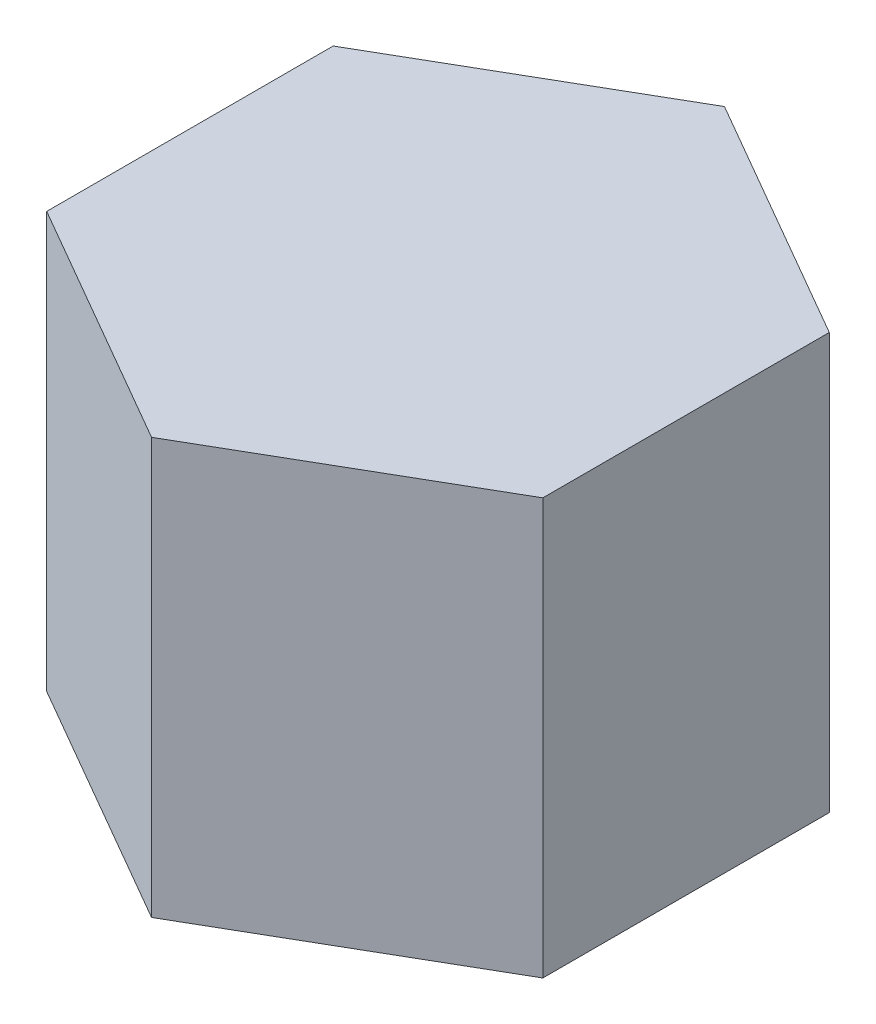
ISO-10303-21;
HEADER;
FILE_DESCRIPTION(('STEP AP214'),'2;1');
FILE_NAME('part.step','',(''),(''),'','','');
FILE_SCHEMA(('AUTOMOTIVE_DESIGN { 1 0 10303 214 1 1 1 1 }'));
ENDSEC;
DATA;
#1=APPLICATION_CONTEXT('core data for automotive mechanical design processes');
#2=APPLICATION_PROTOCOL_DEFINITION('international standard','automotive_design',2000,#1);
#3=PRODUCT_CONTEXT('',#1,'mechanical');
#4=PRODUCT('Part','Part','',(#3));
#5=PRODUCT_RELATED_PRODUCT_CATEGORY('part','',(#4));
#6=PRODUCT_DEFINITION_FORMATION('','',#4);
#7=PRODUCT_DEFINITION_CONTEXT('part definition',#1,'design');
#8=PRODUCT_DEFINITION('design','',#6,#7);
#9=PRODUCT_DEFINITION_SHAPE('','',#8);
#10=(LENGTH_UNIT() NAMED_UNIT(*) SI_UNIT(.MILLI.,.METRE.));
#11=(NAMED_UNIT(*) PLANE_ANGLE_UNIT() SI_UNIT($,.RADIAN.));
#12=(NAMED_UNIT(*) SI_UNIT($,.STERADIAN.) SOLID_ANGLE_UNIT());
#13=UNCERTAINTY_MEASURE_WITH_UNIT(LENGTH_MEASURE(1.E-05),#10,'distance_accuracy_value','');
#14=(GEOMETRIC_REPRESENTATION_CONTEXT(3) GLOBAL_UNCERTAINTY_ASSIGNED_CONTEXT((#13)) GLOBAL_UNIT_ASSIGNED_CONTEXT((#10,
#11,#12)) REPRESENTATION_CONTEXT('',''));
#15=CARTESIAN_POINT('',(0.,0.,0.));
#16=DIRECTION('',(0.,0.,1.));
#17=DIRECTION('',(1.,0.,0.));
#18=AXIS2_PLACEMENT_3D('',#15,#16,#17);
#19=CARTESIAN_POINT('',(206.642660308706,-148.537700895744,289.774920412926));
#20=DIRECTION('',(-0.499999999999943,0.,-0.866025403784472));
#21=DIRECTION('',(-0.866025403784472,0.,0.499999999999943));
#22=AXIS2_PLACEMENT_3D('',#19,#20,#21);
#23=PLANE('',#22);
#24=CARTESIAN_POINT('',(206.339551417382,-149.045793579175,289.949920412926));
#25=DIRECTION('',(0.866025403784471,0.,-0.499999999999943));
#26=VECTOR('',#25,1.);
#27=LINE('',#24,#26);
#28=CARTESIAN_POINT('',(206.339551417382,-149.045793579175,289.949920412926));
#29=VERTEX_POINT('',#28);
#30=CARTESIAN_POINT('',(206.642660308706,-149.045793579175,289.774920412926));
#31=VERTEX_POINT('',#30);
#32=EDGE_CURVE('E170',#29,#31,#27,.T.);
#33=ORIENTED_EDGE('',*,*,#32,.T.);
#34=CARTESIAN_POINT('',(206.642660308706,-148.537700895744,289.774920412926));
#35=DIRECTION('',(0.,-1.,0.));
#36=VECTOR('',#35,1.);
#37=LINE('',#34,#36);
#38=CARTESIAN_POINT('',(206.642660308706,-148.537700895744,289.774920412926));
#39=VERTEX_POINT('',#38);
#40=EDGE_CURVE('E35',#39,#31,#37,.T.);
#41=ORIENTED_EDGE('',*,*,#40,.F.);
#42=CARTESIAN_POINT('',(206.339551417382,-148.537700895744,289.949920412926));
#43=DIRECTION('',(0.866025403784471,0.,-0.499999999999943));
#44=VECTOR('',#43,1.);
#45=LINE('',#42,#44);
#46=CARTESIAN_POINT('',(206.339551417382,-148.537700895744,289.949920412926));
#47=VERTEX_POINT('',#46);
#48=EDGE_CURVE('E159',#47,#39,#45,.T.);
#49=ORIENTED_EDGE('',*,*,#48,.F.);
#50=CARTESIAN_POINT('',(206.339551417382,-148.537700895744,289.949920412926));
#51=DIRECTION('',(0.,-1.,0.));
#52=VECTOR('',#51,1.);
#53=LINE('',#50,#52);
#54=EDGE_CURVE('E10',#47,#29,#53,.T.);
#55=ORIENTED_EDGE('',*,*,#54,.T.);
#56=EDGE_LOOP('',(#33,#41,#49,#55));
#57=FACE_BOUND('',#56,.T.);
#58=ADVANCED_FACE('F16',(#57),#23,.F.);
#59=CARTESIAN_POINT('',(206.339551417382,-148.537700895744,289.949920412926));
#60=DIRECTION('',(0.500000000000062,0.,-0.866025403784403));
#61=DIRECTION('',(-0.866025403784403,0.,-0.500000000000062));
#62=AXIS2_PLACEMENT_3D('',#59,#60,#61);
#63=PLANE('',#62);
#64=CARTESIAN_POINT('',(206.036442526057,-149.045793579175,289.774920412925));
#65=DIRECTION('',(0.866025403784403,0.,0.500000000000062));
#66=VECTOR('',#65,1.);
#67=LINE('',#64,#66);
#68=CARTESIAN_POINT('',(206.036442526057,-149.045793579175,289.774920412925));
#69=VERTEX_POINT('',#68);
#70=EDGE_CURVE('E167',#69,#29,#67,.T.);
#71=ORIENTED_EDGE('',*,*,#70,.T.);
#72=ORIENTED_EDGE('',*,*,#54,.F.);
#73=CARTESIAN_POINT('',(206.036442526057,-148.537700895744,289.774920412925));
#74=DIRECTION('',(0.866025403784403,0.,0.500000000000062));
#75=VECTOR('',#74,1.);
#76=LINE('',#73,#75);
#77=CARTESIAN_POINT('',(206.036442526057,-148.537700895744,289.774920412925));
#78=VERTEX_POINT('',#77);
#79=EDGE_CURVE('E156',#78,#47,#76,.T.);
#80=ORIENTED_EDGE('',*,*,#79,.F.);
#81=CARTESIAN_POINT('',(206.036442526057,-148.537700895744,289.774920412925));
#82=DIRECTION('',(0.,-1.,0.));
#83=VECTOR('',#82,1.);
#84=LINE('',#81,#83);
#85=EDGE_CURVE('E27',#78,#69,#84,.T.);
#86=ORIENTED_EDGE('',*,*,#85,.T.);
#87=EDGE_LOOP('',(#71,#72,#80,#86));
#88=FACE_BOUND('',#87,.T.);
#89=ADVANCED_FACE('F189',(#88),#63,.F.);
#90=CARTESIAN_POINT('',(206.036442526057,-148.537700895744,290.831971220494));
#91=DIRECTION('',(1.,0.,0.));
#92=DIRECTION('',(0.,1.,0.));
#93=AXIS2_PLACEMENT_3D('',#90,#91,#92);
#94=PLANE('',#93);
#95=CARTESIAN_POINT('',(206.036442526057,-149.045793579175,289.424920412926));
#96=DIRECTION('',(0.,0.,1.));
#97=VECTOR('',#96,1.);
#98=LINE('',#95,#97);
#99=CARTESIAN_POINT('',(206.036442526057,-149.045793579175,289.424920412926));
#100=VERTEX_POINT('',#99);
#101=EDGE_CURVE('E163',#100,#69,#98,.T.);
#102=ORIENTED_EDGE('',*,*,#101,.T.);
#103=ORIENTED_EDGE('',*,*,#85,.F.);
#104=CARTESIAN_POINT('',(206.036442526057,-148.537700895744,289.424920412926));
#105=DIRECTION('',(0.,0.,1.));
#106=VECTOR('',#105,1.);
#107=LINE('',#104,#106);
#108=CARTESIAN_POINT('',(206.036442526057,-148.537700895744,289.424920412926));
#109=VERTEX_POINT('',#108);
#110=EDGE_CURVE('E106',#109,#78,#107,.T.);
#111=ORIENTED_EDGE('',*,*,#110,.F.);
#112=CARTESIAN_POINT('',(206.036442526057,-148.537700895744,289.424920412926));
#113=DIRECTION('',(0.,-1.,0.));
#114=VECTOR('',#113,1.);
#115=LINE('',#112,#114);
#116=EDGE_CURVE('E94',#109,#100,#115,.T.);
#117=ORIENTED_EDGE('',*,*,#116,.T.);
#118=EDGE_LOOP('',(#102,#103,#111,#117));
#119=FACE_BOUND('',#118,.T.);
#120=ADVANCED_FACE('F198',(#119),#94,.F.);
#121=CARTESIAN_POINT('',(206.036442526057,-148.537700895744,289.424920412926));
#122=DIRECTION('',(0.499999999999978,0.,0.866025403784452));
#123=DIRECTION('',(0.866025403784452,0.,-0.499999999999978));
#124=AXIS2_PLACEMENT_3D('',#121,#122,#123);
#125=PLANE('',#124);
#126=CARTESIAN_POINT('',(206.339551417382,-149.045793579175,289.249920412926));
#127=DIRECTION('',(-0.866025403784452,0.,0.499999999999978));
#128=VECTOR('',#127,1.);
#129=LINE('',#126,#128);
#130=CARTESIAN_POINT('',(206.339551417382,-149.045793579175,289.249920412926));
#131=VERTEX_POINT('',#130);
#132=EDGE_CURVE('E162',#131,#100,#129,.T.);
#133=ORIENTED_EDGE('',*,*,#132,.T.);
#134=ORIENTED_EDGE('',*,*,#116,.F.);
#135=CARTESIAN_POINT('',(206.339551417382,-148.537700895744,289.249920412926));
#136=DIRECTION('',(-0.866025403784452,0.,0.499999999999978));
#137=VECTOR('',#136,1.);
#138=LINE('',#135,#137);
#139=CARTESIAN_POINT('',(206.339551417382,-148.537700895744,289.249920412926));
#140=VERTEX_POINT('',#139);
#141=EDGE_CURVE('E98',#140,#109,#138,.T.);
#142=ORIENTED_EDGE('',*,*,#141,.F.);
#143=CARTESIAN_POINT('',(206.339551417382,-148.537700895744,289.249920412926));
#144=DIRECTION('',(0.,-1.,0.));
#145=VECTOR('',#144,1.);
#146=LINE('',#143,#145);
#147=EDGE_CURVE('E79',#140,#131,#146,.T.);
#148=ORIENTED_EDGE('',*,*,#147,.T.);
#149=EDGE_LOOP('',(#133,#134,#142,#148));
#150=FACE_BOUND('',#149,.T.);
#151=ADVANCED_FACE('F100',(#150),#125,.F.);
#152=CARTESIAN_POINT('',(206.339551417382,-148.537700895744,289.249920412926));
#153=DIRECTION('',(-0.499999999999943,0.,0.866025403784472));
#154=DIRECTION('',(0.866025403784472,0.,0.499999999999943));
#155=AXIS2_PLACEMENT_3D('',#152,#153,#154);
#156=PLANE('',#155);
#157=CARTESIAN_POINT('',(206.642660308706,-149.045793579175,289.424920412926));
#158=DIRECTION('',(-0.866025403784471,0.,-0.499999999999943));
#159=VECTOR('',#158,1.);
#160=LINE('',#157,#159);
#161=CARTESIAN_POINT('',(206.642660308706,-149.045793579175,289.424920412926));
#162=VERTEX_POINT('',#161);
#163=EDGE_CURVE('E88',#162,#131,#160,.T.);
#164=ORIENTED_EDGE('',*,*,#163,.T.);
#165=ORIENTED_EDGE('',*,*,#147,.F.);
#166=CARTESIAN_POINT('',(206.642660308706,-148.537700895744,289.424920412926));
#167=DIRECTION('',(-0.866025403784471,0.,-0.499999999999943));
#168=VECTOR('',#167,1.);
#169=LINE('',#166,#168);
#170=CARTESIAN_POINT('',(206.642660308706,-148.537700895744,289.424920412926));
#171=VERTEX_POINT('',#170);
#172=EDGE_CURVE('E84',#171,#140,#169,.T.);
#173=ORIENTED_EDGE('',*,*,#172,.F.);
#174=CARTESIAN_POINT('',(206.642660308706,-148.537700895744,289.424920412926));
#175=DIRECTION('',(0.,-1.,0.));
#176=VECTOR('',#175,1.);
#177=LINE('',#174,#176);
#178=EDGE_CURVE('E58',#171,#162,#177,.T.);
#179=ORIENTED_EDGE('',*,*,#178,.T.);
#180=EDGE_LOOP('',(#164,#165,#173,#179));
#181=FACE_BOUND('',#180,.T.);
#182=ADVANCED_FACE('F82',(#181),#156,.F.);
#183=CARTESIAN_POINT('',(206.642660308706,-148.537700895744,290.831971220494));
#184=DIRECTION('',(-1.,0.,0.));
#185=DIRECTION('',(0.,-1.,0.));
#186=AXIS2_PLACEMENT_3D('',#183,#184,#185);
#187=PLANE('',#186);
#188=CARTESIAN_POINT('',(206.642660308706,-149.045793579175,289.774920412926));
#189=DIRECTION('',(0.,0.,-1.));
#190=VECTOR('',#189,1.);
#191=LINE('',#188,#190);
#192=EDGE_CURVE('E160',#31,#162,#191,.T.);
#193=ORIENTED_EDGE('',*,*,#192,.T.);
#194=ORIENTED_EDGE('',*,*,#178,.F.);
#195=CARTESIAN_POINT('',(206.642660308706,-148.537700895744,289.774920412926));
#196=DIRECTION('',(0.,0.,-1.));
#197=VECTOR('',#196,1.);
#198=LINE('',#195,#197);
#199=EDGE_CURVE('E112',#39,#171,#198,.T.);
#200=ORIENTED_EDGE('',*,*,#199,.F.);
#201=ORIENTED_EDGE('',*,*,#40,.T.);
#202=EDGE_LOOP('',(#193,#194,#200,#201));
#203=FACE_BOUND('',#202,.T.);
#204=ADVANCED_FACE('F131',(#203),#187,.F.);
#205=CARTESIAN_POINT('',(206.339551417382,-148.537700895744,290.831971220494));
#206=DIRECTION('',(0.,-1.,0.));
#207=DIRECTION('',(1.,0.,0.));
#208=AXIS2_PLACEMENT_3D('',#205,#206,#207);
#209=PLANE('',#208);
#210=ORIENTED_EDGE('',*,*,#48,.T.);
#211=ORIENTED_EDGE('',*,*,#199,.T.);
#212=ORIENTED_EDGE('',*,*,#172,.T.);
#213=ORIENTED_EDGE('',*,*,#141,.T.);
#214=ORIENTED_EDGE('',*,*,#110,.T.);
#215=ORIENTED_EDGE('',*,*,#79,.T.);
#216=EDGE_LOOP('',(#210,#211,#212,#213,#214,#215));
#217=FACE_BOUND('',#216,.T.);
#218=ADVANCED_FACE('F111',(#217),#209,.F.);
#219=CARTESIAN_POINT('',(206.339551417382,-149.045793579175,290.831971220494));
#220=DIRECTION('',(0.,-1.,0.));
#221=DIRECTION('',(1.,0.,0.));
#222=AXIS2_PLACEMENT_3D('',#219,#220,#221);
#223=PLANE('',#222);
#224=ORIENTED_EDGE('',*,*,#32,.F.);
#225=ORIENTED_EDGE('',*,*,#70,.F.);
#226=ORIENTED_EDGE('',*,*,#101,.F.);
#227=ORIENTED_EDGE('',*,*,#132,.F.);
#228=ORIENTED_EDGE('',*,*,#163,.F.);
#229=ORIENTED_EDGE('',*,*,#192,.F.);
#230=EDGE_LOOP('',(#224,#225,#226,#227,#228,#229));
#231=FACE_BOUND('',#230,.T.);
#232=ADVANCED_FACE('F130',(#231),#223,.T.);
#233=CLOSED_SHELL('',(#58,#89,#120,#151,#182,#204,#218,#232));
#234=MANIFOLD_SOLID_BREP('B1',#233);
#235=ADVANCED_BREP_SHAPE_REPRESENTATION('',(#18,#234),#14);
#236=SHAPE_DEFINITION_REPRESENTATION(#9,#235);
ENDSEC;
END-ISO-10303-21;
